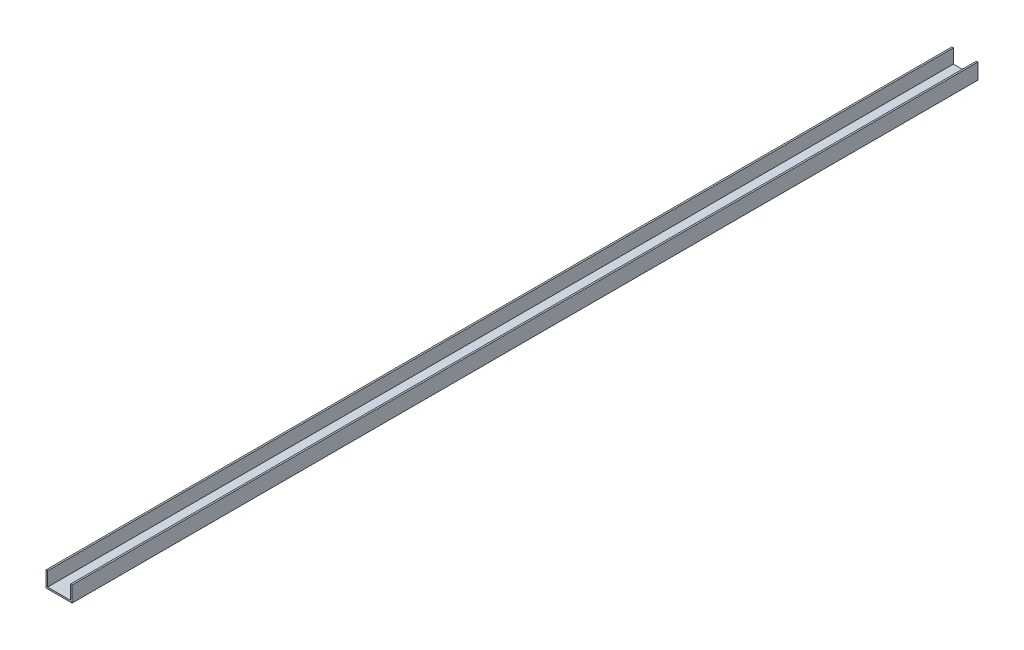
ISO-10303-21;
HEADER;
FILE_DESCRIPTION(('STEP AP214'),'2;1');
FILE_NAME('part.step','',(''),(''),'','','');
FILE_SCHEMA(('AUTOMOTIVE_DESIGN { 1 0 10303 214 1 1 1 1 }'));
ENDSEC;
DATA;
#1=APPLICATION_CONTEXT('core data for automotive mechanical design processes');
#2=APPLICATION_PROTOCOL_DEFINITION('international standard','automotive_design',2000,#1);
#3=PRODUCT_CONTEXT('',#1,'mechanical');
#4=PRODUCT('Part','Part','',(#3));
#5=PRODUCT_RELATED_PRODUCT_CATEGORY('part','',(#4));
#6=PRODUCT_DEFINITION_FORMATION('','',#4);
#7=PRODUCT_DEFINITION_CONTEXT('part definition',#1,'design');
#8=PRODUCT_DEFINITION('design','',#6,#7);
#9=PRODUCT_DEFINITION_SHAPE('','',#8);
#10=(LENGTH_UNIT() NAMED_UNIT(*) SI_UNIT(.MILLI.,.METRE.));
#11=(NAMED_UNIT(*) PLANE_ANGLE_UNIT() SI_UNIT($,.RADIAN.));
#12=(NAMED_UNIT(*) SI_UNIT($,.STERADIAN.) SOLID_ANGLE_UNIT());
#13=UNCERTAINTY_MEASURE_WITH_UNIT(LENGTH_MEASURE(1.E-05),#10,'distance_accuracy_value','');
#14=(GEOMETRIC_REPRESENTATION_CONTEXT(3) GLOBAL_UNCERTAINTY_ASSIGNED_CONTEXT((#13)) GLOBAL_UNIT_ASSIGNED_CONTEXT((#10,
#11,#12)) REPRESENTATION_CONTEXT('',''));
#15=CARTESIAN_POINT('',(0.,0.,0.));
#16=DIRECTION('',(0.,0.,1.));
#17=DIRECTION('',(1.,0.,0.));
#18=AXIS2_PLACEMENT_3D('',#15,#16,#17);
#19=CARTESIAN_POINT('',(-22.,3.,1732.));
#20=DIRECTION('',(0.,-1.,0.));
#21=DIRECTION('',(0.,0.,-1.));
#22=AXIS2_PLACEMENT_3D('',#19,#20,#21);
#23=PLANE('',#22);
#24=DIRECTION('',(-1.,0.,0.));
#25=VECTOR('',#24,1.);
#26=CARTESIAN_POINT('',(-22.,3.,0.));
#27=LINE('',#26,#25);
#28=CARTESIAN_POINT('',(22.,3.,0.));
#29=VERTEX_POINT('',#28);
#30=CARTESIAN_POINT('',(-22.,3.,0.));
#31=VERTEX_POINT('',#30);
#32=EDGE_CURVE('E130',#29,#31,#27,.T.);
#33=ORIENTED_EDGE('',*,*,#32,.T.);
#34=DIRECTION('',(0.,0.,-1.));
#35=VECTOR('',#34,1.);
#36=CARTESIAN_POINT('',(-22.,3.,1732.));
#37=LINE('',#36,#35);
#38=CARTESIAN_POINT('',(-22.,3.,1732.));
#39=VERTEX_POINT('',#38);
#40=EDGE_CURVE('E11',#39,#31,#37,.T.);
#41=ORIENTED_EDGE('',*,*,#40,.F.);
#42=DIRECTION('',(-1.,0.,0.));
#43=VECTOR('',#42,1.);
#44=CARTESIAN_POINT('',(-22.,3.,1732.));
#45=LINE('',#44,#43);
#46=CARTESIAN_POINT('',(22.,3.,1732.));
#47=VERTEX_POINT('',#46);
#48=EDGE_CURVE('E144',#47,#39,#45,.T.);
#49=ORIENTED_EDGE('',*,*,#48,.F.);
#50=DIRECTION('',(0.,0.,-1.));
#51=VECTOR('',#50,1.);
#52=CARTESIAN_POINT('',(22.,3.,1732.));
#53=LINE('',#52,#51);
#54=EDGE_CURVE('E126',#47,#29,#53,.T.);
#55=ORIENTED_EDGE('',*,*,#54,.T.);
#56=EDGE_LOOP('',(#33,#41,#49,#55));
#57=FACE_BOUND('',#56,.T.);
#58=ADVANCED_FACE('F34',(#57),#23,.F.);
#59=CARTESIAN_POINT('',(-22.,3.,1732.));
#60=DIRECTION('',(-1.,0.,0.));
#61=DIRECTION('',(0.,0.,1.));
#62=AXIS2_PLACEMENT_3D('',#59,#60,#61);
#63=PLANE('',#62);
#64=DIRECTION('',(0.,1.,0.));
#65=VECTOR('',#64,1.);
#66=CARTESIAN_POINT('',(-22.,3.,0.));
#67=LINE('',#66,#65);
#68=CARTESIAN_POINT('',(-22.,30.,0.));
#69=VERTEX_POINT('',#68);
#70=EDGE_CURVE('E133',#31,#69,#67,.T.);
#71=ORIENTED_EDGE('',*,*,#70,.T.);
#72=DIRECTION('',(0.,0.,-1.));
#73=VECTOR('',#72,1.);
#74=CARTESIAN_POINT('',(-22.,30.,1732.));
#75=LINE('',#74,#73);
#76=CARTESIAN_POINT('',(-22.,30.,1732.));
#77=VERTEX_POINT('',#76);
#78=EDGE_CURVE('E42',#77,#69,#75,.T.);
#79=ORIENTED_EDGE('',*,*,#78,.F.);
#80=DIRECTION('',(0.,1.,0.));
#81=VECTOR('',#80,1.);
#82=CARTESIAN_POINT('',(-22.,3.,1732.));
#83=LINE('',#82,#81);
#84=EDGE_CURVE('E93',#39,#77,#83,.T.);
#85=ORIENTED_EDGE('',*,*,#84,.F.);
#86=ORIENTED_EDGE('',*,*,#40,.T.);
#87=EDGE_LOOP('',(#71,#79,#85,#86));
#88=FACE_BOUND('',#87,.T.);
#89=ADVANCED_FACE('F179',(#88),#63,.F.);
#90=CARTESIAN_POINT('',(-25.,30.,1732.));
#91=DIRECTION('',(0.,-1.,0.));
#92=DIRECTION('',(0.,0.,-1.));
#93=AXIS2_PLACEMENT_3D('',#90,#91,#92);
#94=PLANE('',#93);
#95=DIRECTION('',(-1.,0.,0.));
#96=VECTOR('',#95,1.);
#97=CARTESIAN_POINT('',(-25.,30.,0.));
#98=LINE('',#97,#96);
#99=CARTESIAN_POINT('',(-25.,30.,0.));
#100=VERTEX_POINT('',#99);
#101=EDGE_CURVE('E135',#69,#100,#98,.T.);
#102=ORIENTED_EDGE('',*,*,#101,.T.);
#103=DIRECTION('',(0.,0.,-1.));
#104=VECTOR('',#103,1.);
#105=CARTESIAN_POINT('',(-25.,30.,1732.));
#106=LINE('',#105,#104);
#107=CARTESIAN_POINT('',(-25.,30.,1732.));
#108=VERTEX_POINT('',#107);
#109=EDGE_CURVE('E151',#108,#100,#106,.T.);
#110=ORIENTED_EDGE('',*,*,#109,.F.);
#111=DIRECTION('',(-1.,0.,0.));
#112=VECTOR('',#111,1.);
#113=CARTESIAN_POINT('',(-25.,30.,1732.));
#114=LINE('',#113,#112);
#115=EDGE_CURVE('E159',#77,#108,#114,.T.);
#116=ORIENTED_EDGE('',*,*,#115,.F.);
#117=ORIENTED_EDGE('',*,*,#78,.T.);
#118=EDGE_LOOP('',(#102,#110,#116,#117));
#119=FACE_BOUND('',#118,.T.);
#120=ADVANCED_FACE('F157',(#119),#94,.F.);
#121=CARTESIAN_POINT('',(-25.,0.,1732.));
#122=DIRECTION('',(1.,0.,0.));
#123=DIRECTION('',(0.,0.,-1.));
#124=AXIS2_PLACEMENT_3D('',#121,#122,#123);
#125=PLANE('',#124);
#126=DIRECTION('',(0.,-1.,0.));
#127=VECTOR('',#126,1.);
#128=CARTESIAN_POINT('',(-25.,0.,0.));
#129=LINE('',#128,#127);
#130=CARTESIAN_POINT('',(-25.,0.,0.));
#131=VERTEX_POINT('',#130);
#132=EDGE_CURVE('E137',#100,#131,#129,.T.);
#133=ORIENTED_EDGE('',*,*,#132,.T.);
#134=DIRECTION('',(0.,0.,-1.));
#135=VECTOR('',#134,1.);
#136=CARTESIAN_POINT('',(-25.,0.,1732.));
#137=LINE('',#136,#135);
#138=CARTESIAN_POINT('',(-25.,0.,1732.));
#139=VERTEX_POINT('',#138);
#140=EDGE_CURVE('E148',#139,#131,#137,.T.);
#141=ORIENTED_EDGE('',*,*,#140,.F.);
#142=DIRECTION('',(0.,-1.,0.));
#143=VECTOR('',#142,1.);
#144=CARTESIAN_POINT('',(-25.,0.,1732.));
#145=LINE('',#144,#143);
#146=EDGE_CURVE('E171',#108,#139,#145,.T.);
#147=ORIENTED_EDGE('',*,*,#146,.F.);
#148=ORIENTED_EDGE('',*,*,#109,.T.);
#149=EDGE_LOOP('',(#133,#141,#147,#148));
#150=FACE_BOUND('',#149,.T.);
#151=ADVANCED_FACE('F167',(#150),#125,.F.);
#152=CARTESIAN_POINT('',(-25.,0.,1732.));
#153=DIRECTION('',(0.,1.,0.));
#154=DIRECTION('',(-1.,0.,0.));
#155=AXIS2_PLACEMENT_3D('',#152,#153,#154);
#156=PLANE('',#155);
#157=DIRECTION('',(1.,0.,0.));
#158=VECTOR('',#157,1.);
#159=CARTESIAN_POINT('',(-25.,0.,0.));
#160=LINE('',#159,#158);
#161=CARTESIAN_POINT('',(25.,0.,0.));
#162=VERTEX_POINT('',#161);
#163=EDGE_CURVE('E139',#131,#162,#160,.T.);
#164=ORIENTED_EDGE('',*,*,#163,.T.);
#165=DIRECTION('',(0.,0.,-1.));
#166=VECTOR('',#165,1.);
#167=CARTESIAN_POINT('',(25.,0.,1732.));
#168=LINE('',#167,#166);
#169=CARTESIAN_POINT('',(25.,0.,1732.));
#170=VERTEX_POINT('',#169);
#171=EDGE_CURVE('E121',#170,#162,#168,.T.);
#172=ORIENTED_EDGE('',*,*,#171,.F.);
#173=DIRECTION('',(1.,0.,0.));
#174=VECTOR('',#173,1.);
#175=CARTESIAN_POINT('',(-25.,0.,1732.));
#176=LINE('',#175,#174);
#177=EDGE_CURVE('E112',#139,#170,#176,.T.);
#178=ORIENTED_EDGE('',*,*,#177,.F.);
#179=ORIENTED_EDGE('',*,*,#140,.T.);
#180=EDGE_LOOP('',(#164,#172,#178,#179));
#181=FACE_BOUND('',#180,.T.);
#182=ADVANCED_FACE('F170',(#181),#156,.F.);
#183=CARTESIAN_POINT('',(25.,0.,1732.));
#184=DIRECTION('',(-1.,0.,0.));
#185=DIRECTION('',(0.,-1.,0.));
#186=AXIS2_PLACEMENT_3D('',#183,#184,#185);
#187=PLANE('',#186);
#188=DIRECTION('',(0.,1.,0.));
#189=VECTOR('',#188,1.);
#190=CARTESIAN_POINT('',(25.,0.,0.));
#191=LINE('',#190,#189);
#192=CARTESIAN_POINT('',(25.,30.,0.));
#193=VERTEX_POINT('',#192);
#194=EDGE_CURVE('E120',#162,#193,#191,.T.);
#195=ORIENTED_EDGE('',*,*,#194,.T.);
#196=DIRECTION('',(0.,0.,-1.));
#197=VECTOR('',#196,1.);
#198=CARTESIAN_POINT('',(25.,30.,1732.));
#199=LINE('',#198,#197);
#200=CARTESIAN_POINT('',(25.,30.,1732.));
#201=VERTEX_POINT('',#200);
#202=EDGE_CURVE('E117',#201,#193,#199,.T.);
#203=ORIENTED_EDGE('',*,*,#202,.F.);
#204=DIRECTION('',(0.,1.,0.));
#205=VECTOR('',#204,1.);
#206=CARTESIAN_POINT('',(25.,0.,1732.));
#207=LINE('',#206,#205);
#208=EDGE_CURVE('E106',#170,#201,#207,.T.);
#209=ORIENTED_EDGE('',*,*,#208,.F.);
#210=ORIENTED_EDGE('',*,*,#171,.T.);
#211=EDGE_LOOP('',(#195,#203,#209,#210));
#212=FACE_BOUND('',#211,.T.);
#213=ADVANCED_FACE('F118',(#212),#187,.F.);
#214=CARTESIAN_POINT('',(22.,30.,1732.));
#215=DIRECTION('',(0.,-1.,0.));
#216=DIRECTION('',(0.,0.,-1.));
#217=AXIS2_PLACEMENT_3D('',#214,#215,#216);
#218=PLANE('',#217);
#219=DIRECTION('',(-1.,0.,0.));
#220=VECTOR('',#219,1.);
#221=CARTESIAN_POINT('',(22.,30.,0.));
#222=LINE('',#221,#220);
#223=CARTESIAN_POINT('',(22.,30.,0.));
#224=VERTEX_POINT('',#223);
#225=EDGE_CURVE('E79',#193,#224,#222,.T.);
#226=ORIENTED_EDGE('',*,*,#225,.T.);
#227=DIRECTION('',(0.,0.,-1.));
#228=VECTOR('',#227,1.);
#229=CARTESIAN_POINT('',(22.,30.,1732.));
#230=LINE('',#229,#228);
#231=CARTESIAN_POINT('',(22.,30.,1732.));
#232=VERTEX_POINT('',#231);
#233=EDGE_CURVE('E122',#232,#224,#230,.T.);
#234=ORIENTED_EDGE('',*,*,#233,.F.);
#235=DIRECTION('',(-1.,0.,0.));
#236=VECTOR('',#235,1.);
#237=CARTESIAN_POINT('',(22.,30.,1732.));
#238=LINE('',#237,#236);
#239=EDGE_CURVE('E110',#201,#232,#238,.T.);
#240=ORIENTED_EDGE('',*,*,#239,.F.);
#241=ORIENTED_EDGE('',*,*,#202,.T.);
#242=EDGE_LOOP('',(#226,#234,#240,#241));
#243=FACE_BOUND('',#242,.T.);
#244=ADVANCED_FACE('F124',(#243),#218,.F.);
#245=CARTESIAN_POINT('',(22.,3.,1732.));
#246=DIRECTION('',(1.,0.,0.));
#247=DIRECTION('',(0.,0.,-1.));
#248=AXIS2_PLACEMENT_3D('',#245,#246,#247);
#249=PLANE('',#248);
#250=DIRECTION('',(0.,-1.,0.));
#251=VECTOR('',#250,1.);
#252=CARTESIAN_POINT('',(22.,3.,0.));
#253=LINE('',#252,#251);
#254=EDGE_CURVE('E85',#224,#29,#253,.T.);
#255=ORIENTED_EDGE('',*,*,#254,.T.);
#256=ORIENTED_EDGE('',*,*,#54,.F.);
#257=DIRECTION('',(0.,-1.,0.));
#258=VECTOR('',#257,1.);
#259=CARTESIAN_POINT('',(22.,3.,1732.));
#260=LINE('',#259,#258);
#261=EDGE_CURVE('E50',#232,#47,#260,.T.);
#262=ORIENTED_EDGE('',*,*,#261,.F.);
#263=ORIENTED_EDGE('',*,*,#233,.T.);
#264=EDGE_LOOP('',(#255,#256,#262,#263));
#265=FACE_BOUND('',#264,.T.);
#266=ADVANCED_FACE('F195',(#265),#249,.F.);
#267=CARTESIAN_POINT('',(0.,0.,1732.));
#268=DIRECTION('',(0.,0.,1.));
#269=DIRECTION('',(1.,0.,0.));
#270=AXIS2_PLACEMENT_3D('',#267,#268,#269);
#271=PLANE('',#270);
#272=ORIENTED_EDGE('',*,*,#48,.T.);
#273=ORIENTED_EDGE('',*,*,#84,.T.);
#274=ORIENTED_EDGE('',*,*,#115,.T.);
#275=ORIENTED_EDGE('',*,*,#146,.T.);
#276=ORIENTED_EDGE('',*,*,#177,.T.);
#277=ORIENTED_EDGE('',*,*,#208,.T.);
#278=ORIENTED_EDGE('',*,*,#239,.T.);
#279=ORIENTED_EDGE('',*,*,#261,.T.);
#280=EDGE_LOOP('',(#272,#273,#274,#275,#276,#277,#278,#279));
#281=FACE_BOUND('',#280,.T.);
#282=ADVANCED_FACE('F108',(#281),#271,.T.);
#283=CARTESIAN_POINT('',(0.,0.,0.));
#284=DIRECTION('',(0.,0.,1.));
#285=DIRECTION('',(1.,0.,0.));
#286=AXIS2_PLACEMENT_3D('',#283,#284,#285);
#287=PLANE('',#286);
#288=ORIENTED_EDGE('',*,*,#32,.F.);
#289=ORIENTED_EDGE('',*,*,#254,.F.);
#290=ORIENTED_EDGE('',*,*,#225,.F.);
#291=ORIENTED_EDGE('',*,*,#194,.F.);
#292=ORIENTED_EDGE('',*,*,#163,.F.);
#293=ORIENTED_EDGE('',*,*,#132,.F.);
#294=ORIENTED_EDGE('',*,*,#101,.F.);
#295=ORIENTED_EDGE('',*,*,#70,.F.);
#296=EDGE_LOOP('',(#288,#289,#290,#291,#292,#293,#294,#295));
#297=FACE_BOUND('',#296,.T.);
#298=ADVANCED_FACE('F163',(#297),#287,.F.);
#299=CLOSED_SHELL('',(#58,#89,#120,#151,#182,#213,#244,#266,#282,#298));
#300=MANIFOLD_SOLID_BREP('B2',#299);
#301=ADVANCED_BREP_SHAPE_REPRESENTATION('',(#18,#300),#14);
#302=SHAPE_DEFINITION_REPRESENTATION(#9,#301);
ENDSEC;
END-ISO-10303-21;
